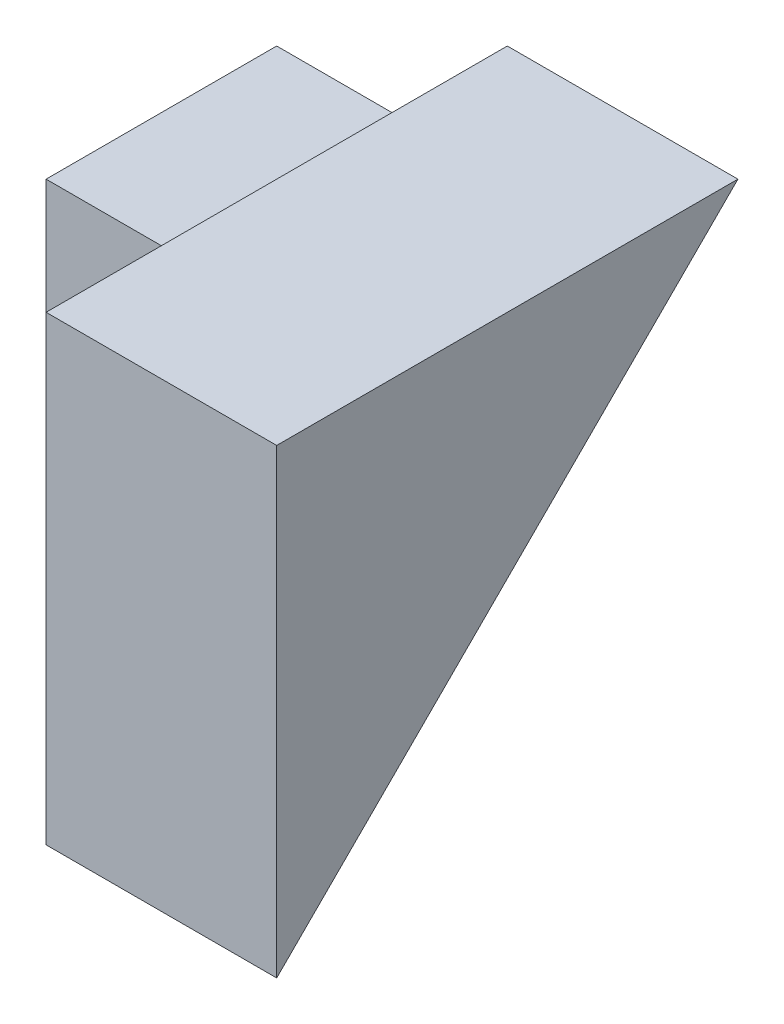
ISO-10303-21;
HEADER;
FILE_DESCRIPTION(('STEP AP214'),'2;1');
FILE_NAME('part.step','',(''),(''),'','','');
FILE_SCHEMA(('AUTOMOTIVE_DESIGN { 1 0 10303 214 1 1 1 1 }'));
ENDSEC;
DATA;
#1=APPLICATION_CONTEXT('core data for automotive mechanical design processes');
#2=APPLICATION_PROTOCOL_DEFINITION('international standard','automotive_design',2000,#1);
#3=PRODUCT_CONTEXT('',#1,'mechanical');
#4=PRODUCT('Part','Part','',(#3));
#5=PRODUCT_RELATED_PRODUCT_CATEGORY('part','',(#4));
#6=PRODUCT_DEFINITION_FORMATION('','',#4);
#7=PRODUCT_DEFINITION_CONTEXT('part definition',#1,'design');
#8=PRODUCT_DEFINITION('design','',#6,#7);
#9=PRODUCT_DEFINITION_SHAPE('','',#8);
#10=(LENGTH_UNIT() NAMED_UNIT(*) SI_UNIT(.MILLI.,.METRE.));
#11=(NAMED_UNIT(*) PLANE_ANGLE_UNIT() SI_UNIT($,.RADIAN.));
#12=(NAMED_UNIT(*) SI_UNIT($,.STERADIAN.) SOLID_ANGLE_UNIT());
#13=UNCERTAINTY_MEASURE_WITH_UNIT(LENGTH_MEASURE(1.E-05),#10,'distance_accuracy_value','');
#14=(GEOMETRIC_REPRESENTATION_CONTEXT(3) GLOBAL_UNCERTAINTY_ASSIGNED_CONTEXT((#13)) GLOBAL_UNIT_ASSIGNED_CONTEXT((#10,
#11,#12)) REPRESENTATION_CONTEXT('',''));
#15=CARTESIAN_POINT('',(0.,0.,0.));
#16=DIRECTION('',(0.,0.,1.));
#17=DIRECTION('',(1.,0.,0.));
#18=AXIS2_PLACEMENT_3D('',#15,#16,#17);
#19=CARTESIAN_POINT('',(2.,0.,0.));
#20=DIRECTION('',(0.,1.,0.));
#21=DIRECTION('',(0.,0.,1.));
#22=AXIS2_PLACEMENT_3D('',#19,#20,#21);
#23=PLANE('',#22);
#24=DIRECTION('',(0.,0.,-1.));
#25=VECTOR('',#24,1.);
#26=CARTESIAN_POINT('',(0.,0.,0.));
#27=LINE('',#26,#25);
#28=CARTESIAN_POINT('',(0.,0.,-2.));
#29=VERTEX_POINT('',#28);
#30=CARTESIAN_POINT('',(0.,0.,-4.));
#31=VERTEX_POINT('',#30);
#32=EDGE_CURVE('E112',#29,#31,#27,.T.);
#33=ORIENTED_EDGE('',*,*,#32,.F.);
#34=DIRECTION('',(1.,0.,0.));
#35=VECTOR('',#34,1.);
#36=CARTESIAN_POINT('',(-2.,0.,-2.));
#37=LINE('',#36,#35);
#38=CARTESIAN_POINT('',(-2.,0.,-2.));
#39=VERTEX_POINT('',#38);
#40=EDGE_CURVE('E129',#39,#29,#37,.T.);
#41=ORIENTED_EDGE('',*,*,#40,.F.);
#42=DIRECTION('',(0.,0.,1.));
#43=VECTOR('',#42,1.);
#44=CARTESIAN_POINT('',(-2.,0.,-4.));
#45=LINE('',#44,#43);
#46=CARTESIAN_POINT('',(-2.,0.,-4.));
#47=VERTEX_POINT('',#46);
#48=EDGE_CURVE('E172',#47,#39,#45,.T.);
#49=ORIENTED_EDGE('',*,*,#48,.F.);
#50=DIRECTION('',(-1.,0.,0.));
#51=VECTOR('',#50,1.);
#52=CARTESIAN_POINT('',(2.,0.,-4.));
#53=LINE('',#52,#51);
#54=EDGE_CURVE('E43',#31,#47,#53,.T.);
#55=ORIENTED_EDGE('',*,*,#54,.F.);
#56=EDGE_LOOP('',(#33,#41,#49,#55));
#57=FACE_BOUND('',#56,.T.);
#58=ADVANCED_FACE('F33',(#57),#23,.F.);
#59=CARTESIAN_POINT('',(2.,0.,-4.));
#60=DIRECTION('',(0.,0.,1.));
#61=DIRECTION('',(1.,0.,0.));
#62=AXIS2_PLACEMENT_3D('',#59,#60,#61);
#63=PLANE('',#62);
#64=DIRECTION('',(0.,1.,0.));
#65=VECTOR('',#64,1.);
#66=CARTESIAN_POINT('',(0.,0.,-4.));
#67=LINE('',#66,#65);
#68=CARTESIAN_POINT('',(0.,3.,-4.));
#69=VERTEX_POINT('',#68);
#70=EDGE_CURVE('E51',#31,#69,#67,.T.);
#71=ORIENTED_EDGE('',*,*,#70,.F.);
#72=ORIENTED_EDGE('',*,*,#54,.T.);
#73=DIRECTION('',(0.,-1.,0.));
#74=VECTOR('',#73,1.);
#75=CARTESIAN_POINT('',(-2.,0.,-4.));
#76=LINE('',#75,#74);
#77=CARTESIAN_POINT('',(-2.,3.,-4.));
#78=VERTEX_POINT('',#77);
#79=EDGE_CURVE('E149',#78,#47,#76,.T.);
#80=ORIENTED_EDGE('',*,*,#79,.F.);
#81=DIRECTION('',(1.,0.,0.));
#82=VECTOR('',#81,1.);
#83=CARTESIAN_POINT('',(-2.,3.,-4.));
#84=LINE('',#83,#82);
#85=EDGE_CURVE('E150',#78,#69,#84,.T.);
#86=ORIENTED_EDGE('',*,*,#85,.T.);
#87=EDGE_LOOP('',(#71,#72,#80,#86));
#88=FACE_BOUND('',#87,.T.);
#89=ADVANCED_FACE('F167',(#88),#63,.F.);
#90=CARTESIAN_POINT('',(2.,0.,0.));
#91=DIRECTION('',(0.,0.,-1.));
#92=DIRECTION('',(-1.,0.,0.));
#93=AXIS2_PLACEMENT_3D('',#90,#91,#92);
#94=PLANE('',#93);
#95=DIRECTION('',(0.,-1.,0.));
#96=VECTOR('',#95,1.);
#97=CARTESIAN_POINT('',(0.,0.,0.));
#98=LINE('',#97,#96);
#99=CARTESIAN_POINT('',(0.,4.,0.));
#100=VERTEX_POINT('',#99);
#101=CARTESIAN_POINT('',(0.,0.,0.));
#102=VERTEX_POINT('',#101);
#103=EDGE_CURVE('E125',#100,#102,#98,.T.);
#104=ORIENTED_EDGE('',*,*,#103,.T.);
#105=DIRECTION('',(-1.,0.,0.));
#106=VECTOR('',#105,1.);
#107=CARTESIAN_POINT('',(2.,0.,0.));
#108=LINE('',#107,#106);
#109=CARTESIAN_POINT('',(2.,0.,0.));
#110=VERTEX_POINT('',#109);
#111=EDGE_CURVE('E11',#110,#102,#108,.T.);
#112=ORIENTED_EDGE('',*,*,#111,.F.);
#113=DIRECTION('',(0.,-1.,0.));
#114=VECTOR('',#113,1.);
#115=CARTESIAN_POINT('',(2.,0.,0.));
#116=LINE('',#115,#114);
#117=CARTESIAN_POINT('',(2.,4.,0.));
#118=VERTEX_POINT('',#117);
#119=EDGE_CURVE('E126',#118,#110,#116,.T.);
#120=ORIENTED_EDGE('',*,*,#119,.F.);
#121=DIRECTION('',(-1.,0.,0.));
#122=VECTOR('',#121,1.);
#123=CARTESIAN_POINT('',(2.,4.,0.));
#124=LINE('',#123,#122);
#125=EDGE_CURVE('E119',#118,#100,#124,.T.);
#126=ORIENTED_EDGE('',*,*,#125,.T.);
#127=EDGE_LOOP('',(#104,#112,#120,#126));
#128=FACE_BOUND('',#127,.T.);
#129=ADVANCED_FACE('F35',(#128),#94,.F.);
#130=CARTESIAN_POINT('',(2.,4.,0.));
#131=DIRECTION('',(0.,-1.,0.));
#132=DIRECTION('',(0.,0.,-1.));
#133=AXIS2_PLACEMENT_3D('',#130,#131,#132);
#134=PLANE('',#133);
#135=DIRECTION('',(0.,0.,1.));
#136=VECTOR('',#135,1.);
#137=CARTESIAN_POINT('',(0.,4.,0.));
#138=LINE('',#137,#136);
#139=CARTESIAN_POINT('',(0.,4.,-4.));
#140=VERTEX_POINT('',#139);
#141=EDGE_CURVE('E117',#140,#100,#138,.T.);
#142=ORIENTED_EDGE('',*,*,#141,.T.);
#143=ORIENTED_EDGE('',*,*,#125,.F.);
#144=DIRECTION('',(0.,0.,1.));
#145=VECTOR('',#144,1.);
#146=CARTESIAN_POINT('',(2.,4.,0.));
#147=LINE('',#146,#145);
#148=CARTESIAN_POINT('',(2.,4.,-4.));
#149=VERTEX_POINT('',#148);
#150=EDGE_CURVE('E60',#149,#118,#147,.T.);
#151=ORIENTED_EDGE('',*,*,#150,.F.);
#152=DIRECTION('',(-1.,0.,0.));
#153=VECTOR('',#152,1.);
#154=CARTESIAN_POINT('',(2.,4.,-4.));
#155=LINE('',#154,#153);
#156=EDGE_CURVE('E105',#149,#140,#155,.T.);
#157=ORIENTED_EDGE('',*,*,#156,.T.);
#158=EDGE_LOOP('',(#142,#143,#151,#157));
#159=FACE_BOUND('',#158,.T.);
#160=ADVANCED_FACE('F116',(#159),#134,.F.);
#161=CARTESIAN_POINT('',(2.,0.,0.));
#162=DIRECTION('',(-1.,0.,0.));
#163=DIRECTION('',(0.,0.,1.));
#164=AXIS2_PLACEMENT_3D('',#161,#162,#163);
#165=PLANE('',#164);
#166=ORIENTED_EDGE('',*,*,#119,.T.);
#167=DIRECTION('',(0.,-0.707106781186548,0.707106781186548));
#168=VECTOR('',#167,1.);
#169=CARTESIAN_POINT('',(2.,0.,0.));
#170=LINE('',#169,#168);
#171=EDGE_CURVE('E183',#149,#110,#170,.T.);
#172=ORIENTED_EDGE('',*,*,#171,.F.);
#173=ORIENTED_EDGE('',*,*,#150,.T.);
#174=EDGE_LOOP('',(#166,#172,#173));
#175=FACE_BOUND('',#174,.T.);
#176=ADVANCED_FACE('F212',(#175),#165,.F.);
#177=CARTESIAN_POINT('',(0.,0.,0.));
#178=DIRECTION('',(-1.,0.,0.));
#179=DIRECTION('',(0.,0.,1.));
#180=AXIS2_PLACEMENT_3D('',#177,#178,#179);
#181=PLANE('',#180);
#182=DIRECTION('',(0.,-0.707106781186548,0.707106781186548));
#183=VECTOR('',#182,1.);
#184=CARTESIAN_POINT('',(0.,0.,0.));
#185=LINE('',#184,#183);
#186=CARTESIAN_POINT('',(0.,2.,-2.));
#187=VERTEX_POINT('',#186);
#188=EDGE_CURVE('E114',#187,#102,#185,.T.);
#189=ORIENTED_EDGE('',*,*,#188,.T.);
#190=ORIENTED_EDGE('',*,*,#103,.F.);
#191=ORIENTED_EDGE('',*,*,#141,.F.);
#192=CARTESIAN_POINT('',(0.,3.,-3.));
#193=VERTEX_POINT('',#192);
#194=EDGE_CURVE('E102',#140,#193,#185,.T.);
#195=ORIENTED_EDGE('',*,*,#194,.T.);
#196=DIRECTION('',(0.,0.,-1.));
#197=VECTOR('',#196,1.);
#198=CARTESIAN_POINT('',(0.,3.,-4.));
#199=LINE('',#198,#197);
#200=CARTESIAN_POINT('',(0.,3.,-2.));
#201=VERTEX_POINT('',#200);
#202=EDGE_CURVE('E146',#201,#193,#199,.T.);
#203=ORIENTED_EDGE('',*,*,#202,.F.);
#204=DIRECTION('',(0.,1.,0.));
#205=VECTOR('',#204,1.);
#206=CARTESIAN_POINT('',(0.,0.,-2.));
#207=LINE('',#206,#205);
#208=EDGE_CURVE('E37',#187,#201,#207,.T.);
#209=ORIENTED_EDGE('',*,*,#208,.F.);
#210=EDGE_LOOP('',(#189,#190,#191,#195,#203,#209));
#211=FACE_BOUND('',#210,.T.);
#212=ADVANCED_FACE('F123',(#211),#181,.T.);
#213=CARTESIAN_POINT('',(-2.,0.,-2.));
#214=DIRECTION('',(0.,0.,-1.));
#215=DIRECTION('',(-1.,0.,0.));
#216=AXIS2_PLACEMENT_3D('',#213,#214,#215);
#217=PLANE('',#216);
#218=EDGE_CURVE('E135',#29,#187,#207,.T.);
#219=ORIENTED_EDGE('',*,*,#218,.T.);
#220=ORIENTED_EDGE('',*,*,#208,.T.);
#221=DIRECTION('',(1.,0.,0.));
#222=VECTOR('',#221,1.);
#223=CARTESIAN_POINT('',(-2.,3.,-2.));
#224=LINE('',#223,#222);
#225=CARTESIAN_POINT('',(-2.,3.,-2.));
#226=VERTEX_POINT('',#225);
#227=EDGE_CURVE('E143',#226,#201,#224,.T.);
#228=ORIENTED_EDGE('',*,*,#227,.F.);
#229=DIRECTION('',(0.,1.,0.));
#230=VECTOR('',#229,1.);
#231=CARTESIAN_POINT('',(-2.,0.,-2.));
#232=LINE('',#231,#230);
#233=EDGE_CURVE('E170',#39,#226,#232,.T.);
#234=ORIENTED_EDGE('',*,*,#233,.F.);
#235=ORIENTED_EDGE('',*,*,#40,.T.);
#236=EDGE_LOOP('',(#219,#220,#228,#234,#235));
#237=FACE_BOUND('',#236,.T.);
#238=ADVANCED_FACE('F188',(#237),#217,.F.);
#239=CARTESIAN_POINT('',(-2.,3.,-4.));
#240=DIRECTION('',(0.,-1.,0.));
#241=DIRECTION('',(0.,0.,-1.));
#242=AXIS2_PLACEMENT_3D('',#239,#240,#241);
#243=PLANE('',#242);
#244=ORIENTED_EDGE('',*,*,#202,.T.);
#245=EDGE_CURVE('E137',#193,#69,#199,.T.);
#246=ORIENTED_EDGE('',*,*,#245,.T.);
#247=ORIENTED_EDGE('',*,*,#85,.F.);
#248=DIRECTION('',(0.,0.,-1.));
#249=VECTOR('',#248,1.);
#250=CARTESIAN_POINT('',(-2.,3.,-4.));
#251=LINE('',#250,#249);
#252=EDGE_CURVE('E155',#226,#78,#251,.T.);
#253=ORIENTED_EDGE('',*,*,#252,.F.);
#254=ORIENTED_EDGE('',*,*,#227,.T.);
#255=EDGE_LOOP('',(#244,#246,#247,#253,#254));
#256=FACE_BOUND('',#255,.T.);
#257=ADVANCED_FACE('F162',(#256),#243,.F.);
#258=CARTESIAN_POINT('',(-2.,0.,0.));
#259=DIRECTION('',(1.,0.,0.));
#260=DIRECTION('',(0.,0.,-1.));
#261=AXIS2_PLACEMENT_3D('',#258,#259,#260);
#262=PLANE('',#261);
#263=ORIENTED_EDGE('',*,*,#79,.T.);
#264=ORIENTED_EDGE('',*,*,#48,.T.);
#265=ORIENTED_EDGE('',*,*,#233,.T.);
#266=ORIENTED_EDGE('',*,*,#252,.T.);
#267=EDGE_LOOP('',(#263,#264,#265,#266));
#268=FACE_BOUND('',#267,.T.);
#269=ADVANCED_FACE('F192',(#268),#262,.F.);
#270=CARTESIAN_POINT('',(0.,0.,0.));
#271=DIRECTION('',(1.,0.,0.));
#272=DIRECTION('',(0.,0.,-1.));
#273=AXIS2_PLACEMENT_3D('',#270,#271,#272);
#274=PLANE('',#273);
#275=ORIENTED_EDGE('',*,*,#218,.F.);
#276=ORIENTED_EDGE('',*,*,#32,.T.);
#277=ORIENTED_EDGE('',*,*,#70,.T.);
#278=ORIENTED_EDGE('',*,*,#245,.F.);
#279=EDGE_CURVE('E107',#193,#187,#185,.T.);
#280=ORIENTED_EDGE('',*,*,#279,.T.);
#281=EDGE_LOOP('',(#275,#276,#277,#278,#280));
#282=FACE_BOUND('',#281,.T.);
#283=ADVANCED_FACE('F185',(#282),#274,.T.);
#284=CARTESIAN_POINT('',(0.,0.,0.));
#285=DIRECTION('',(0.,0.707106781186547,0.707106781186547));
#286=DIRECTION('',(0.,-0.707106781186548,0.707106781186548));
#287=AXIS2_PLACEMENT_3D('',#284,#285,#286);
#288=PLANE('',#287);
#289=ORIENTED_EDGE('',*,*,#171,.T.);
#290=ORIENTED_EDGE('',*,*,#111,.T.);
#291=ORIENTED_EDGE('',*,*,#188,.F.);
#292=ORIENTED_EDGE('',*,*,#279,.F.);
#293=ORIENTED_EDGE('',*,*,#194,.F.);
#294=ORIENTED_EDGE('',*,*,#156,.F.);
#295=EDGE_LOOP('',(#289,#290,#291,#292,#293,#294));
#296=FACE_BOUND('',#295,.T.);
#297=ADVANCED_FACE('F104',(#296),#288,.F.);
#298=CLOSED_SHELL('',(#58,#89,#129,#160,#176,#212,#238,#257,#269,#283,#297));
#299=MANIFOLD_SOLID_BREP('B2',#298);
#300=ADVANCED_BREP_SHAPE_REPRESENTATION('',(#18,#299),#14);
#301=SHAPE_DEFINITION_REPRESENTATION(#9,#300);
ENDSEC;
END-ISO-10303-21;
